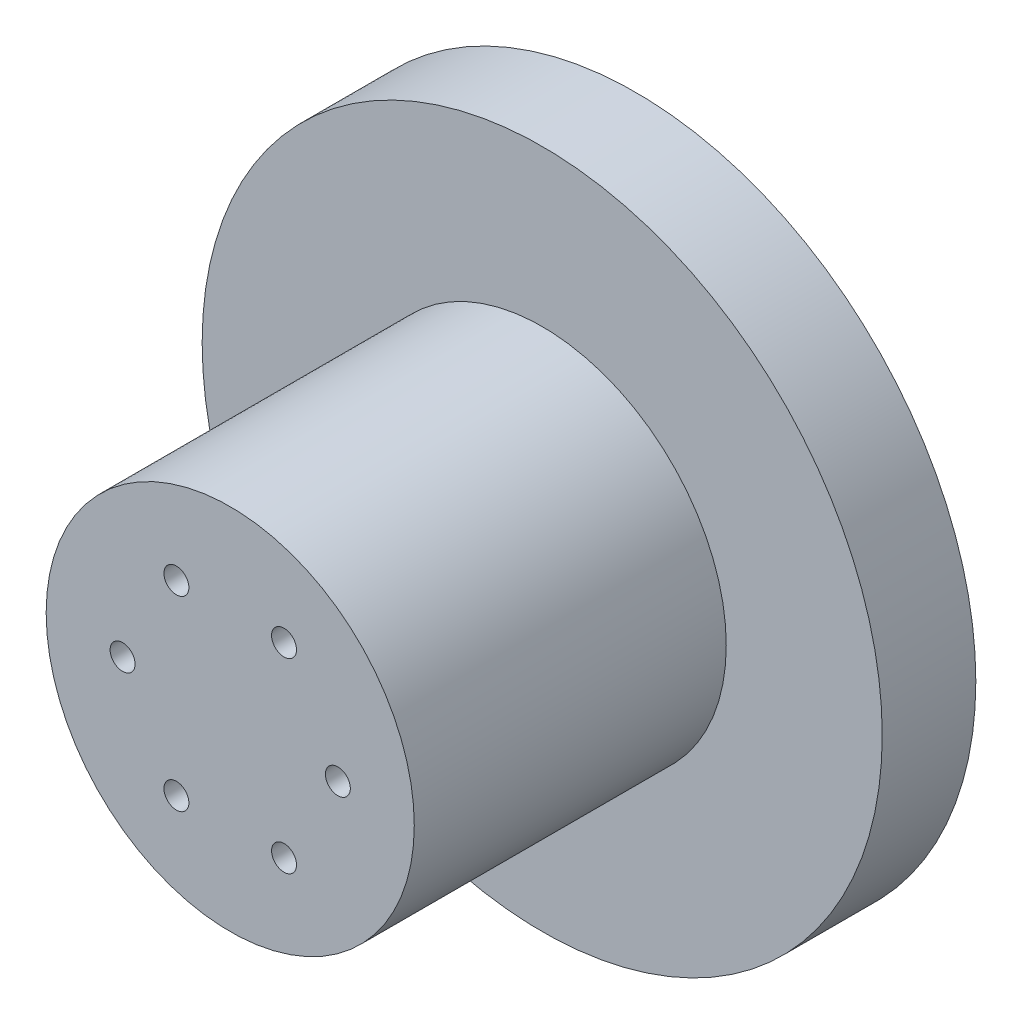
ISO-10303-21;
HEADER;
FILE_DESCRIPTION(('STEP AP214'),'2;1');
FILE_NAME('part.step','',(''),(''),'','','');
FILE_SCHEMA(('AUTOMOTIVE_DESIGN { 1 0 10303 214 1 1 1 1 }'));
ENDSEC;
DATA;
#1=APPLICATION_CONTEXT('core data for automotive mechanical design processes');
#2=APPLICATION_PROTOCOL_DEFINITION('international standard','automotive_design',2000,#1);
#3=PRODUCT_CONTEXT('',#1,'mechanical');
#4=PRODUCT('Part','Part','',(#3));
#5=PRODUCT_RELATED_PRODUCT_CATEGORY('part','',(#4));
#6=PRODUCT_DEFINITION_FORMATION('','',#4);
#7=PRODUCT_DEFINITION_CONTEXT('part definition',#1,'design');
#8=PRODUCT_DEFINITION('design','',#6,#7);
#9=PRODUCT_DEFINITION_SHAPE('','',#8);
#10=(LENGTH_UNIT() NAMED_UNIT(*) SI_UNIT(.MILLI.,.METRE.));
#11=(NAMED_UNIT(*) PLANE_ANGLE_UNIT() SI_UNIT($,.RADIAN.));
#12=(NAMED_UNIT(*) SI_UNIT($,.STERADIAN.) SOLID_ANGLE_UNIT());
#13=UNCERTAINTY_MEASURE_WITH_UNIT(LENGTH_MEASURE(1.E-05),#10,'distance_accuracy_value','');
#14=(GEOMETRIC_REPRESENTATION_CONTEXT(3) GLOBAL_UNCERTAINTY_ASSIGNED_CONTEXT((#13)) GLOBAL_UNIT_ASSIGNED_CONTEXT((#10,
#11,#12)) REPRESENTATION_CONTEXT('',''));
#15=CARTESIAN_POINT('',(0.,0.,0.));
#16=DIRECTION('',(0.,0.,1.));
#17=DIRECTION('',(1.,0.,0.));
#18=AXIS2_PLACEMENT_3D('',#15,#16,#17);
#19=CARTESIAN_POINT('',(0.,0.,50.));
#20=DIRECTION('',(0.,0.,-1.));
#21=DIRECTION('',(-1.,0.,0.));
#22=AXIS2_PLACEMENT_3D('',#19,#20,#21);
#23=CYLINDRICAL_SURFACE('',#22,29.5);
#24=CARTESIAN_POINT('',(0.,0.,50.));
#25=DIRECTION('',(0.,0.,1.));
#26=DIRECTION('',(1.,0.,0.));
#27=AXIS2_PLACEMENT_3D('',#24,#25,#26);
#28=CIRCLE('',#27,29.5);
#29=CARTESIAN_POINT('',(29.5,0.,50.));
#30=VERTEX_POINT('',#29);
#31=EDGE_CURVE('E10',#30,#30,#28,.T.);
#32=ORIENTED_EDGE('',*,*,#31,.F.);
#33=EDGE_LOOP('',(#32));
#34=FACE_BOUND('',#33,.T.);
#35=CARTESIAN_POINT('',(0.,0.,0.));
#36=DIRECTION('',(0.,0.,1.));
#37=DIRECTION('',(1.,0.,0.));
#38=AXIS2_PLACEMENT_3D('',#35,#36,#37);
#39=CIRCLE('',#38,29.5);
#40=CARTESIAN_POINT('',(29.5,0.,0.));
#41=VERTEX_POINT('',#40);
#42=EDGE_CURVE('E53',#41,#41,#39,.T.);
#43=ORIENTED_EDGE('',*,*,#42,.T.);
#44=EDGE_LOOP('',(#43));
#45=FACE_BOUND('',#44,.T.);
#46=ADVANCED_FACE('F38',(#34,#45),#23,.T.);
#47=CARTESIAN_POINT('',(0.,0.,50.));
#48=DIRECTION('',(0.,0.,1.));
#49=DIRECTION('',(1.,0.,0.));
#50=AXIS2_PLACEMENT_3D('',#47,#48,#49);
#51=PLANE('',#50);
#52=CARTESIAN_POINT('',(-17.25,0.,50.));
#53=DIRECTION('',(0.,0.,1.));
#54=DIRECTION('',(1.,0.,0.));
#55=AXIS2_PLACEMENT_3D('',#52,#53,#54);
#56=CIRCLE('',#55,2.);
#57=CARTESIAN_POINT('',(-15.25,0.,50.));
#58=VERTEX_POINT('',#57);
#59=EDGE_CURVE('E62',#58,#58,#56,.T.);
#60=ORIENTED_EDGE('',*,*,#59,.F.);
#61=EDGE_LOOP('',(#60));
#62=FACE_BOUND('',#61,.T.);
#63=CARTESIAN_POINT('',(-8.62500000000017,-14.9389382152815,50.));
#64=DIRECTION('',(0.,0.,1.));
#65=DIRECTION('',(1.,0.,0.));
#66=AXIS2_PLACEMENT_3D('',#63,#64,#65);
#67=CIRCLE('',#66,2.);
#68=CARTESIAN_POINT('',(-6.62500000000017,-14.9389382152815,50.));
#69=VERTEX_POINT('',#68);
#70=EDGE_CURVE('E56',#69,#69,#67,.T.);
#71=ORIENTED_EDGE('',*,*,#70,.F.);
#72=EDGE_LOOP('',(#71));
#73=FACE_BOUND('',#72,.T.);
#74=CARTESIAN_POINT('',(8.62499999999986,-14.9389382152816,50.));
#75=DIRECTION('',(0.,0.,1.));
#76=DIRECTION('',(1.,0.,0.));
#77=AXIS2_PLACEMENT_3D('',#74,#75,#76);
#78=CIRCLE('',#77,2.);
#79=CARTESIAN_POINT('',(10.6249999999999,-14.9389382152816,50.));
#80=VERTEX_POINT('',#79);
#81=EDGE_CURVE('E130',#80,#80,#78,.T.);
#82=ORIENTED_EDGE('',*,*,#81,.F.);
#83=EDGE_LOOP('',(#82));
#84=FACE_BOUND('',#83,.T.);
#85=CARTESIAN_POINT('',(17.25,-1.20456106190088E-13,50.));
#86=DIRECTION('',(0.,0.,1.));
#87=DIRECTION('',(1.,0.,0.));
#88=AXIS2_PLACEMENT_3D('',#85,#86,#87);
#89=CIRCLE('',#88,2.);
#90=CARTESIAN_POINT('',(19.25,-1.20456106190088E-13,50.));
#91=VERTEX_POINT('',#90);
#92=EDGE_CURVE('E136',#91,#91,#89,.T.);
#93=ORIENTED_EDGE('',*,*,#92,.F.);
#94=EDGE_LOOP('',(#93));
#95=FACE_BOUND('',#94,.T.);
#96=CARTESIAN_POINT('',(8.62500000000007,14.9389382152815,50.));
#97=DIRECTION('',(0.,0.,1.));
#98=DIRECTION('',(1.,0.,0.));
#99=AXIS2_PLACEMENT_3D('',#96,#97,#98);
#100=CIRCLE('',#99,2.);
#101=CARTESIAN_POINT('',(10.6250000000001,14.9389382152815,50.));
#102=VERTEX_POINT('',#101);
#103=EDGE_CURVE('E133',#102,#102,#100,.T.);
#104=ORIENTED_EDGE('',*,*,#103,.F.);
#105=EDGE_LOOP('',(#104));
#106=FACE_BOUND('',#105,.T.);
#107=CARTESIAN_POINT('',(-8.62499999999997,14.9389382152816,50.));
#108=DIRECTION('',(0.,0.,1.));
#109=DIRECTION('',(1.,0.,0.));
#110=AXIS2_PLACEMENT_3D('',#107,#108,#109);
#111=CIRCLE('',#110,2.);
#112=CARTESIAN_POINT('',(-6.62499999999996,14.9389382152816,50.));
#113=VERTEX_POINT('',#112);
#114=EDGE_CURVE('E127',#113,#113,#111,.T.);
#115=ORIENTED_EDGE('',*,*,#114,.F.);
#116=EDGE_LOOP('',(#115));
#117=FACE_BOUND('',#116,.T.);
#118=ORIENTED_EDGE('',*,*,#31,.T.);
#119=EDGE_LOOP('',(#118));
#120=FACE_BOUND('',#119,.T.);
#121=ADVANCED_FACE('F97',(#62,#73,#84,#95,#106,#117,#120),#51,.T.);
#122=CARTESIAN_POINT('',(0.,0.,50.));
#123=DIRECTION('',(0.,0.,-1.));
#124=DIRECTION('',(-1.,0.,0.));
#125=AXIS2_PLACEMENT_3D('',#122,#123,#124);
#126=CYLINDRICAL_SURFACE('',#125,25.5);
#127=CARTESIAN_POINT('',(0.,0.,46.));
#128=DIRECTION('',(0.,0.,1.));
#129=DIRECTION('',(1.,0.,0.));
#130=AXIS2_PLACEMENT_3D('',#127,#128,#129);
#131=CIRCLE('',#130,25.5);
#132=CARTESIAN_POINT('',(25.5,0.,46.));
#133=VERTEX_POINT('',#132);
#134=EDGE_CURVE('E45',#133,#133,#131,.T.);
#135=ORIENTED_EDGE('',*,*,#134,.T.);
#136=EDGE_LOOP('',(#135));
#137=FACE_BOUND('',#136,.T.);
#138=CARTESIAN_POINT('',(0.,0.,-15.));
#139=DIRECTION('',(0.,0.,-1.));
#140=DIRECTION('',(-1.,0.,0.));
#141=AXIS2_PLACEMENT_3D('',#138,#139,#140);
#142=CIRCLE('',#141,25.5);
#143=CARTESIAN_POINT('',(-25.5,0.,-15.));
#144=VERTEX_POINT('',#143);
#145=EDGE_CURVE('E57',#144,#144,#142,.F.);
#146=ORIENTED_EDGE('',*,*,#145,.F.);
#147=EDGE_LOOP('',(#146));
#148=FACE_BOUND('',#147,.T.);
#149=ADVANCED_FACE('F102',(#137,#148),#126,.F.);
#150=CARTESIAN_POINT('',(0.,0.,46.));
#151=DIRECTION('',(0.,0.,1.));
#152=DIRECTION('',(1.,0.,0.));
#153=AXIS2_PLACEMENT_3D('',#150,#151,#152);
#154=PLANE('',#153);
#155=CARTESIAN_POINT('',(-17.25,0.,46.));
#156=DIRECTION('',(0.,0.,1.));
#157=DIRECTION('',(1.,0.,0.));
#158=AXIS2_PLACEMENT_3D('',#155,#156,#157);
#159=CIRCLE('',#158,2.);
#160=CARTESIAN_POINT('',(-15.25,0.,46.));
#161=VERTEX_POINT('',#160);
#162=EDGE_CURVE('E41',#161,#161,#159,.T.);
#163=ORIENTED_EDGE('',*,*,#162,.T.);
#164=EDGE_LOOP('',(#163));
#165=FACE_BOUND('',#164,.T.);
#166=CARTESIAN_POINT('',(-8.62500000000017,-14.9389382152815,46.));
#167=DIRECTION('',(0.,0.,1.));
#168=DIRECTION('',(1.,0.,0.));
#169=AXIS2_PLACEMENT_3D('',#166,#167,#168);
#170=CIRCLE('',#169,2.);
#171=CARTESIAN_POINT('',(-6.62500000000017,-14.9389382152815,46.));
#172=VERTEX_POINT('',#171);
#173=EDGE_CURVE('E70',#172,#172,#170,.T.);
#174=ORIENTED_EDGE('',*,*,#173,.T.);
#175=EDGE_LOOP('',(#174));
#176=FACE_BOUND('',#175,.T.);
#177=CARTESIAN_POINT('',(8.62499999999986,-14.9389382152816,46.));
#178=DIRECTION('',(0.,0.,1.));
#179=DIRECTION('',(1.,0.,0.));
#180=AXIS2_PLACEMENT_3D('',#177,#178,#179);
#181=CIRCLE('',#180,2.);
#182=CARTESIAN_POINT('',(10.6249999999999,-14.9389382152816,46.));
#183=VERTEX_POINT('',#182);
#184=EDGE_CURVE('E68',#183,#183,#181,.T.);
#185=ORIENTED_EDGE('',*,*,#184,.T.);
#186=EDGE_LOOP('',(#185));
#187=FACE_BOUND('',#186,.T.);
#188=CARTESIAN_POINT('',(17.25,-1.20456106190088E-13,46.));
#189=DIRECTION('',(0.,0.,1.));
#190=DIRECTION('',(1.,0.,0.));
#191=AXIS2_PLACEMENT_3D('',#188,#189,#190);
#192=CIRCLE('',#191,2.);
#193=CARTESIAN_POINT('',(19.25,-1.20456106190088E-13,46.));
#194=VERTEX_POINT('',#193);
#195=EDGE_CURVE('E65',#194,#194,#192,.T.);
#196=ORIENTED_EDGE('',*,*,#195,.T.);
#197=EDGE_LOOP('',(#196));
#198=FACE_BOUND('',#197,.T.);
#199=CARTESIAN_POINT('',(8.62500000000007,14.9389382152815,46.));
#200=DIRECTION('',(0.,0.,1.));
#201=DIRECTION('',(1.,0.,0.));
#202=AXIS2_PLACEMENT_3D('',#199,#200,#201);
#203=CIRCLE('',#202,2.);
#204=CARTESIAN_POINT('',(10.6250000000001,14.9389382152815,46.));
#205=VERTEX_POINT('',#204);
#206=EDGE_CURVE('E61',#205,#205,#203,.T.);
#207=ORIENTED_EDGE('',*,*,#206,.T.);
#208=EDGE_LOOP('',(#207));
#209=FACE_BOUND('',#208,.T.);
#210=CARTESIAN_POINT('',(-8.62499999999997,14.9389382152816,46.));
#211=DIRECTION('',(0.,0.,1.));
#212=DIRECTION('',(1.,0.,0.));
#213=AXIS2_PLACEMENT_3D('',#210,#211,#212);
#214=CIRCLE('',#213,2.);
#215=CARTESIAN_POINT('',(-6.62499999999996,14.9389382152816,46.));
#216=VERTEX_POINT('',#215);
#217=EDGE_CURVE('E58',#216,#216,#214,.T.);
#218=ORIENTED_EDGE('',*,*,#217,.T.);
#219=EDGE_LOOP('',(#218));
#220=FACE_BOUND('',#219,.T.);
#221=ORIENTED_EDGE('',*,*,#134,.F.);
#222=EDGE_LOOP('',(#221));
#223=FACE_BOUND('',#222,.T.);
#224=ADVANCED_FACE('F77',(#165,#176,#187,#198,#209,#220,#223),#154,.F.);
#225=CARTESIAN_POINT('',(-8.62499999999997,14.9389382152816,0.));
#226=DIRECTION('',(0.,0.,1.));
#227=DIRECTION('',(1.,0.,0.));
#228=AXIS2_PLACEMENT_3D('',#225,#226,#227);
#229=CYLINDRICAL_SURFACE('',#228,2.);
#230=ORIENTED_EDGE('',*,*,#114,.T.);
#231=EDGE_LOOP('',(#230));
#232=FACE_BOUND('',#231,.T.);
#233=ORIENTED_EDGE('',*,*,#217,.F.);
#234=EDGE_LOOP('',(#233));
#235=FACE_BOUND('',#234,.T.);
#236=ADVANCED_FACE('F150',(#232,#235),#229,.F.);
#237=CARTESIAN_POINT('',(8.62500000000007,14.9389382152815,0.));
#238=DIRECTION('',(0.,0.,1.));
#239=DIRECTION('',(1.,0.,0.));
#240=AXIS2_PLACEMENT_3D('',#237,#238,#239);
#241=CYLINDRICAL_SURFACE('',#240,2.);
#242=ORIENTED_EDGE('',*,*,#103,.T.);
#243=EDGE_LOOP('',(#242));
#244=FACE_BOUND('',#243,.T.);
#245=ORIENTED_EDGE('',*,*,#206,.F.);
#246=EDGE_LOOP('',(#245));
#247=FACE_BOUND('',#246,.T.);
#248=ADVANCED_FACE('F153',(#244,#247),#241,.F.);
#249=CARTESIAN_POINT('',(17.25,-1.20456106190088E-13,0.));
#250=DIRECTION('',(0.,0.,1.));
#251=DIRECTION('',(1.,0.,0.));
#252=AXIS2_PLACEMENT_3D('',#249,#250,#251);
#253=CYLINDRICAL_SURFACE('',#252,2.);
#254=ORIENTED_EDGE('',*,*,#92,.T.);
#255=EDGE_LOOP('',(#254));
#256=FACE_BOUND('',#255,.T.);
#257=ORIENTED_EDGE('',*,*,#195,.F.);
#258=EDGE_LOOP('',(#257));
#259=FACE_BOUND('',#258,.T.);
#260=ADVANCED_FACE('F283',(#256,#259),#253,.F.);
#261=CARTESIAN_POINT('',(8.62499999999986,-14.9389382152816,0.));
#262=DIRECTION('',(0.,0.,1.));
#263=DIRECTION('',(1.,0.,0.));
#264=AXIS2_PLACEMENT_3D('',#261,#262,#263);
#265=CYLINDRICAL_SURFACE('',#264,2.);
#266=ORIENTED_EDGE('',*,*,#81,.T.);
#267=EDGE_LOOP('',(#266));
#268=FACE_BOUND('',#267,.T.);
#269=ORIENTED_EDGE('',*,*,#184,.F.);
#270=EDGE_LOOP('',(#269));
#271=FACE_BOUND('',#270,.T.);
#272=ADVANCED_FACE('F92',(#268,#271),#265,.F.);
#273=CARTESIAN_POINT('',(-8.62500000000017,-14.9389382152815,0.));
#274=DIRECTION('',(0.,0.,1.));
#275=DIRECTION('',(1.,0.,0.));
#276=AXIS2_PLACEMENT_3D('',#273,#274,#275);
#277=CYLINDRICAL_SURFACE('',#276,2.);
#278=ORIENTED_EDGE('',*,*,#70,.T.);
#279=EDGE_LOOP('',(#278));
#280=FACE_BOUND('',#279,.T.);
#281=ORIENTED_EDGE('',*,*,#173,.F.);
#282=EDGE_LOOP('',(#281));
#283=FACE_BOUND('',#282,.T.);
#284=ADVANCED_FACE('F82',(#280,#283),#277,.F.);
#285=CARTESIAN_POINT('',(-17.25,0.,0.));
#286=DIRECTION('',(0.,0.,1.));
#287=DIRECTION('',(1.,0.,0.));
#288=AXIS2_PLACEMENT_3D('',#285,#286,#287);
#289=CYLINDRICAL_SURFACE('',#288,2.);
#290=ORIENTED_EDGE('',*,*,#59,.T.);
#291=EDGE_LOOP('',(#290));
#292=FACE_BOUND('',#291,.T.);
#293=ORIENTED_EDGE('',*,*,#162,.F.);
#294=EDGE_LOOP('',(#293));
#295=FACE_BOUND('',#294,.T.);
#296=ADVANCED_FACE('F79',(#292,#295),#289,.F.);
#297=CARTESIAN_POINT('',(0.,0.,-15.));
#298=DIRECTION('',(0.,0.,1.));
#299=DIRECTION('',(1.,0.,0.));
#300=AXIS2_PLACEMENT_3D('',#297,#298,#299);
#301=CYLINDRICAL_SURFACE('',#300,54.5);
#302=CARTESIAN_POINT('',(0.,0.,-15.));
#303=DIRECTION('',(0.,0.,-1.));
#304=DIRECTION('',(-1.,0.,0.));
#305=AXIS2_PLACEMENT_3D('',#302,#303,#304);
#306=CIRCLE('',#305,54.5);
#307=CARTESIAN_POINT('',(-54.5,0.,-15.));
#308=VERTEX_POINT('',#307);
#309=EDGE_CURVE('E116',#308,#308,#306,.T.);
#310=ORIENTED_EDGE('',*,*,#309,.F.);
#311=EDGE_LOOP('',(#310));
#312=FACE_BOUND('',#311,.T.);
#313=CARTESIAN_POINT('',(0.,0.,0.));
#314=DIRECTION('',(0.,0.,-1.));
#315=DIRECTION('',(-1.,0.,0.));
#316=AXIS2_PLACEMENT_3D('',#313,#314,#315);
#317=CIRCLE('',#316,54.5);
#318=CARTESIAN_POINT('',(-54.5,0.,0.));
#319=VERTEX_POINT('',#318);
#320=EDGE_CURVE('E114',#319,#319,#317,.T.);
#321=ORIENTED_EDGE('',*,*,#320,.T.);
#322=EDGE_LOOP('',(#321));
#323=FACE_BOUND('',#322,.T.);
#324=ADVANCED_FACE('F81',(#312,#323),#301,.T.);
#325=CARTESIAN_POINT('',(0.,0.,-15.));
#326=DIRECTION('',(0.,0.,-1.));
#327=DIRECTION('',(-1.,0.,0.));
#328=AXIS2_PLACEMENT_3D('',#325,#326,#327);
#329=PLANE('',#328);
#330=CARTESIAN_POINT('',(42.,0.,-15.));
#331=DIRECTION('',(0.,0.,-1.));
#332=DIRECTION('',(-1.,0.,0.));
#333=AXIS2_PLACEMENT_3D('',#330,#331,#332);
#334=CIRCLE('',#333,2.);
#335=CARTESIAN_POINT('',(40.,0.,-15.));
#336=VERTEX_POINT('',#335);
#337=EDGE_CURVE('E122',#336,#336,#334,.T.);
#338=ORIENTED_EDGE('',*,*,#337,.F.);
#339=EDGE_LOOP('',(#338));
#340=FACE_BOUND('',#339,.T.);
#341=CARTESIAN_POINT('',(-42.,0.,-15.));
#342=DIRECTION('',(0.,0.,-1.));
#343=DIRECTION('',(-1.,0.,0.));
#344=AXIS2_PLACEMENT_3D('',#341,#342,#343);
#345=CIRCLE('',#344,2.);
#346=CARTESIAN_POINT('',(-44.,0.,-15.));
#347=VERTEX_POINT('',#346);
#348=EDGE_CURVE('E195',#347,#347,#345,.T.);
#349=ORIENTED_EDGE('',*,*,#348,.F.);
#350=EDGE_LOOP('',(#349));
#351=FACE_BOUND('',#350,.T.);
#352=ORIENTED_EDGE('',*,*,#309,.T.);
#353=EDGE_LOOP('',(#352));
#354=FACE_BOUND('',#353,.T.);
#355=ORIENTED_EDGE('',*,*,#145,.T.);
#356=EDGE_LOOP('',(#355));
#357=FACE_BOUND('',#356,.T.);
#358=ADVANCED_FACE('F89',(#340,#351,#354,#357),#329,.T.);
#359=CARTESIAN_POINT('',(0.,0.,0.));
#360=DIRECTION('',(0.,0.,-1.));
#361=DIRECTION('',(-1.,0.,0.));
#362=AXIS2_PLACEMENT_3D('',#359,#360,#361);
#363=PLANE('',#362);
#364=ORIENTED_EDGE('',*,*,#42,.F.);
#365=EDGE_LOOP('',(#364));
#366=FACE_BOUND('',#365,.T.);
#367=ORIENTED_EDGE('',*,*,#320,.F.);
#368=EDGE_LOOP('',(#367));
#369=FACE_BOUND('',#368,.T.);
#370=ADVANCED_FACE('F107',(#366,#369),#363,.F.);
#371=CARTESIAN_POINT('',(-42.,0.,-11.));
#372=DIRECTION('',(0.,0.,-1.));
#373=DIRECTION('',(-1.,0.,0.));
#374=AXIS2_PLACEMENT_3D('',#371,#372,#373);
#375=CYLINDRICAL_SURFACE('',#374,2.);
#376=CARTESIAN_POINT('',(-42.,0.,-11.));
#377=DIRECTION('',(0.,0.,-1.));
#378=DIRECTION('',(-1.,0.,0.));
#379=AXIS2_PLACEMENT_3D('',#376,#377,#378);
#380=CIRCLE('',#379,2.);
#381=CARTESIAN_POINT('',(-44.,0.,-11.));
#382=VERTEX_POINT('',#381);
#383=EDGE_CURVE('E198',#382,#382,#380,.T.);
#384=ORIENTED_EDGE('',*,*,#383,.F.);
#385=EDGE_LOOP('',(#384));
#386=FACE_BOUND('',#385,.T.);
#387=ORIENTED_EDGE('',*,*,#348,.T.);
#388=EDGE_LOOP('',(#387));
#389=FACE_BOUND('',#388,.T.);
#390=ADVANCED_FACE('F110',(#386,#389),#375,.F.);
#391=CARTESIAN_POINT('',(-42.,0.,-11.));
#392=DIRECTION('',(0.,0.,-1.));
#393=DIRECTION('',(-1.,0.,0.));
#394=AXIS2_PLACEMENT_3D('',#391,#392,#393);
#395=PLANE('',#394);
#396=ORIENTED_EDGE('',*,*,#383,.T.);
#397=EDGE_LOOP('',(#396));
#398=FACE_BOUND('',#397,.T.);
#399=ADVANCED_FACE('F176',(#398),#395,.T.);
#400=CARTESIAN_POINT('',(42.,0.,-11.));
#401=DIRECTION('',(0.,0.,-1.));
#402=DIRECTION('',(-1.,0.,0.));
#403=AXIS2_PLACEMENT_3D('',#400,#401,#402);
#404=CYLINDRICAL_SURFACE('',#403,2.);
#405=CARTESIAN_POINT('',(42.,0.,-11.));
#406=DIRECTION('',(0.,0.,-1.));
#407=DIRECTION('',(-1.,0.,0.));
#408=AXIS2_PLACEMENT_3D('',#405,#406,#407);
#409=CIRCLE('',#408,2.);
#410=CARTESIAN_POINT('',(40.,0.,-11.));
#411=VERTEX_POINT('',#410);
#412=EDGE_CURVE('E117',#411,#411,#409,.T.);
#413=ORIENTED_EDGE('',*,*,#412,.F.);
#414=EDGE_LOOP('',(#413));
#415=FACE_BOUND('',#414,.T.);
#416=ORIENTED_EDGE('',*,*,#337,.T.);
#417=EDGE_LOOP('',(#416));
#418=FACE_BOUND('',#417,.T.);
#419=ADVANCED_FACE('F179',(#415,#418),#404,.F.);
#420=CARTESIAN_POINT('',(42.,0.,-11.));
#421=DIRECTION('',(0.,0.,-1.));
#422=DIRECTION('',(-1.,0.,0.));
#423=AXIS2_PLACEMENT_3D('',#420,#421,#422);
#424=PLANE('',#423);
#425=ORIENTED_EDGE('',*,*,#412,.T.);
#426=EDGE_LOOP('',(#425));
#427=FACE_BOUND('',#426,.T.);
#428=ADVANCED_FACE('F186',(#427),#424,.T.);
#429=CLOSED_SHELL('',(#46,#121,#149,#224,#236,#248,#260,#272,#284,#296,#324,#358,#370,#390,#399,
#419,#428));
#430=MANIFOLD_SOLID_BREP('B2',#429);
#431=ADVANCED_BREP_SHAPE_REPRESENTATION('',(#18,#430),#14);
#432=SHAPE_DEFINITION_REPRESENTATION(#9,#431);
ENDSEC;
END-ISO-10303-21;
